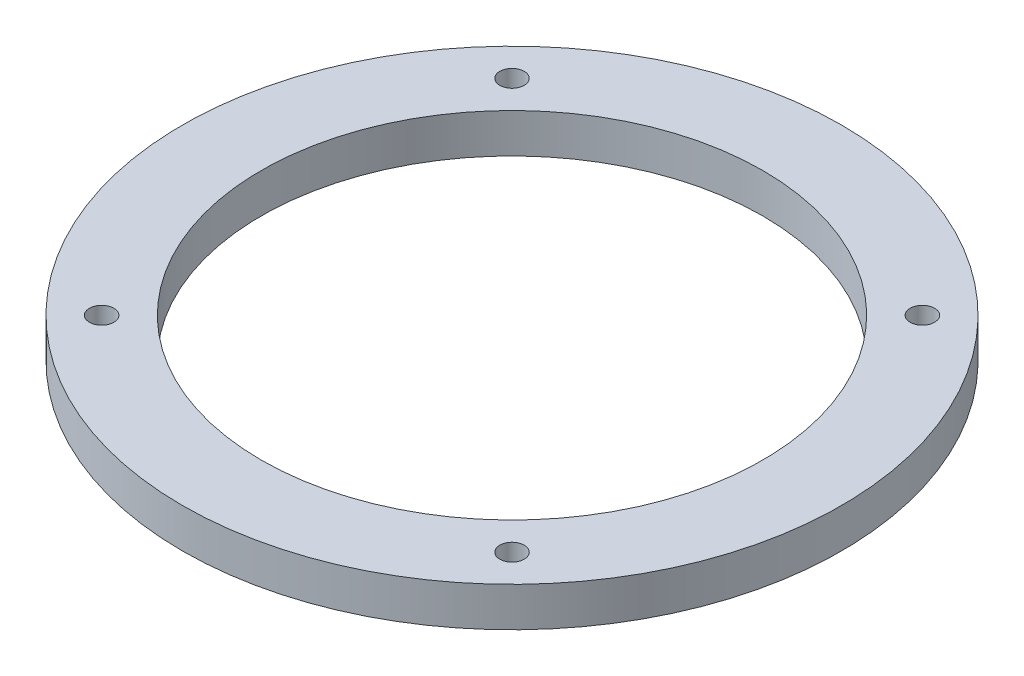
ISO-10303-21;
HEADER;
FILE_DESCRIPTION(('STEP AP214'),'2;1');
FILE_NAME('part.step','',(''),(''),'','','');
FILE_SCHEMA(('AUTOMOTIVE_DESIGN { 1 0 10303 214 1 1 1 1 }'));
ENDSEC;
DATA;
#1=APPLICATION_CONTEXT('core data for automotive mechanical design processes');
#2=APPLICATION_PROTOCOL_DEFINITION('international standard','automotive_design',2000,#1);
#3=PRODUCT_CONTEXT('',#1,'mechanical');
#4=PRODUCT('Part','Part','',(#3));
#5=PRODUCT_RELATED_PRODUCT_CATEGORY('part','',(#4));
#6=PRODUCT_DEFINITION_FORMATION('','',#4);
#7=PRODUCT_DEFINITION_CONTEXT('part definition',#1,'design');
#8=PRODUCT_DEFINITION('design','',#6,#7);
#9=PRODUCT_DEFINITION_SHAPE('','',#8);
#10=(LENGTH_UNIT() NAMED_UNIT(*) SI_UNIT(.MILLI.,.METRE.));
#11=(NAMED_UNIT(*) PLANE_ANGLE_UNIT() SI_UNIT($,.RADIAN.));
#12=(NAMED_UNIT(*) SI_UNIT($,.STERADIAN.) SOLID_ANGLE_UNIT());
#13=UNCERTAINTY_MEASURE_WITH_UNIT(LENGTH_MEASURE(1.E-05),#10,'distance_accuracy_value','');
#14=(GEOMETRIC_REPRESENTATION_CONTEXT(3) GLOBAL_UNCERTAINTY_ASSIGNED_CONTEXT((#13)) GLOBAL_UNIT_ASSIGNED_CONTEXT((#10,
#11,#12)) REPRESENTATION_CONTEXT('',''));
#15=CARTESIAN_POINT('',(0.,0.,0.));
#16=DIRECTION('',(0.,0.,1.));
#17=DIRECTION('',(1.,0.,0.));
#18=AXIS2_PLACEMENT_3D('',#15,#16,#17);
#19=CARTESIAN_POINT('',(0.,5.,0.));
#20=DIRECTION('',(0.,1.,0.));
#21=DIRECTION('',(0.,0.,1.));
#22=AXIS2_PLACEMENT_3D('',#19,#20,#21);
#23=PLANE('',#22);
#24=CARTESIAN_POINT('',(26.0500000000015,5.,26.0499999999985));
#25=DIRECTION('',(0.,1.,0.));
#26=DIRECTION('',(0.,0.,1.));
#27=AXIS2_PLACEMENT_3D('',#24,#25,#26);
#28=CIRCLE('',#27,1.55000000000205);
#29=CARTESIAN_POINT('',(26.0500000000015,5.,27.6000000000006));
#30=VERTEX_POINT('',#29);
#31=EDGE_CURVE('E59',#30,#30,#28,.T.);
#32=ORIENTED_EDGE('',*,*,#31,.F.);
#33=EDGE_LOOP('',(#32));
#34=FACE_BOUND('',#33,.T.);
#35=CARTESIAN_POINT('',(0.,5.,0.));
#36=DIRECTION('',(0.,1.,0.));
#37=DIRECTION('',(0.,0.,1.));
#38=AXIS2_PLACEMENT_3D('',#35,#36,#37);
#39=CIRCLE('',#38,31.8402632998191);
#40=CARTESIAN_POINT('',(0.,5.,31.8402632998191));
#41=VERTEX_POINT('',#40);
#42=EDGE_CURVE('E47',#41,#41,#39,.T.);
#43=ORIENTED_EDGE('',*,*,#42,.F.);
#44=EDGE_LOOP('',(#43));
#45=FACE_BOUND('',#44,.T.);
#46=CARTESIAN_POINT('',(0.,5.,0.));
#47=DIRECTION('',(0.,1.,0.));
#48=DIRECTION('',(0.,0.,1.));
#49=AXIS2_PLACEMENT_3D('',#46,#47,#48);
#50=CIRCLE('',#49,41.8402632998191);
#51=CARTESIAN_POINT('',(0.,5.,41.8402632998191));
#52=VERTEX_POINT('',#51);
#53=EDGE_CURVE('E10',#52,#52,#50,.T.);
#54=ORIENTED_EDGE('',*,*,#53,.T.);
#55=EDGE_LOOP('',(#54));
#56=FACE_BOUND('',#55,.T.);
#57=CARTESIAN_POINT('',(-26.05,5.,-26.05));
#58=DIRECTION('',(0.,1.,0.));
#59=DIRECTION('',(0.,0.,1.));
#60=AXIS2_PLACEMENT_3D('',#57,#58,#59);
#61=CIRCLE('',#60,1.55);
#62=CARTESIAN_POINT('',(-26.05,5.,-24.5));
#63=VERTEX_POINT('',#62);
#64=EDGE_CURVE('E42',#63,#63,#61,.T.);
#65=ORIENTED_EDGE('',*,*,#64,.F.);
#66=EDGE_LOOP('',(#65));
#67=FACE_BOUND('',#66,.T.);
#68=CARTESIAN_POINT('',(26.05,5.,-26.0500000000015));
#69=DIRECTION('',(0.,1.,0.));
#70=DIRECTION('',(0.,0.,1.));
#71=AXIS2_PLACEMENT_3D('',#68,#69,#70);
#72=CIRCLE('',#71,1.55000000000151);
#73=CARTESIAN_POINT('',(26.05,5.,-24.5));
#74=VERTEX_POINT('',#73);
#75=EDGE_CURVE('E53',#74,#74,#72,.T.);
#76=ORIENTED_EDGE('',*,*,#75,.F.);
#77=EDGE_LOOP('',(#76));
#78=FACE_BOUND('',#77,.T.);
#79=CARTESIAN_POINT('',(-26.0499999999985,5.,26.05));
#80=DIRECTION('',(0.,1.,0.));
#81=DIRECTION('',(0.,0.,1.));
#82=AXIS2_PLACEMENT_3D('',#79,#80,#81);
#83=CIRCLE('',#82,1.55000000000077);
#84=CARTESIAN_POINT('',(-26.0499999999985,5.,27.6000000000008));
#85=VERTEX_POINT('',#84);
#86=EDGE_CURVE('E65',#85,#85,#83,.T.);
#87=ORIENTED_EDGE('',*,*,#86,.F.);
#88=EDGE_LOOP('',(#87));
#89=FACE_BOUND('',#88,.T.);
#90=ADVANCED_FACE('F31',(#34,#45,#56,#67,#78,#89),#23,.T.);
#91=CARTESIAN_POINT('',(0.,0.,0.));
#92=DIRECTION('',(0.,1.,0.));
#93=DIRECTION('',(0.,0.,1.));
#94=AXIS2_PLACEMENT_3D('',#91,#92,#93);
#95=PLANE('',#94);
#96=CARTESIAN_POINT('',(0.,0.,0.));
#97=DIRECTION('',(0.,1.,0.));
#98=DIRECTION('',(0.,0.,1.));
#99=AXIS2_PLACEMENT_3D('',#96,#97,#98);
#100=CIRCLE('',#99,41.8402632998191);
#101=CARTESIAN_POINT('',(0.,0.,41.8402632998191));
#102=VERTEX_POINT('',#101);
#103=EDGE_CURVE('E35',#102,#102,#100,.T.);
#104=ORIENTED_EDGE('',*,*,#103,.F.);
#105=EDGE_LOOP('',(#104));
#106=FACE_BOUND('',#105,.T.);
#107=CARTESIAN_POINT('',(-26.05,0.,-26.05));
#108=DIRECTION('',(0.,1.,0.));
#109=DIRECTION('',(0.,0.,1.));
#110=AXIS2_PLACEMENT_3D('',#107,#108,#109);
#111=CIRCLE('',#110,1.55);
#112=CARTESIAN_POINT('',(-26.05,0.,-24.5));
#113=VERTEX_POINT('',#112);
#114=EDGE_CURVE('E44',#113,#113,#111,.T.);
#115=ORIENTED_EDGE('',*,*,#114,.T.);
#116=EDGE_LOOP('',(#115));
#117=FACE_BOUND('',#116,.T.);
#118=CARTESIAN_POINT('',(0.,0.,0.));
#119=DIRECTION('',(0.,1.,0.));
#120=DIRECTION('',(0.,0.,1.));
#121=AXIS2_PLACEMENT_3D('',#118,#119,#120);
#122=CIRCLE('',#121,31.8402632998191);
#123=CARTESIAN_POINT('',(0.,0.,31.8402632998191));
#124=VERTEX_POINT('',#123);
#125=EDGE_CURVE('E50',#124,#124,#122,.T.);
#126=ORIENTED_EDGE('',*,*,#125,.T.);
#127=EDGE_LOOP('',(#126));
#128=FACE_BOUND('',#127,.T.);
#129=CARTESIAN_POINT('',(26.05,0.,-26.0500000000015));
#130=DIRECTION('',(0.,1.,0.));
#131=DIRECTION('',(0.,0.,1.));
#132=AXIS2_PLACEMENT_3D('',#129,#130,#131);
#133=CIRCLE('',#132,1.55000000000151);
#134=CARTESIAN_POINT('',(26.05,0.,-24.5));
#135=VERTEX_POINT('',#134);
#136=EDGE_CURVE('E56',#135,#135,#133,.T.);
#137=ORIENTED_EDGE('',*,*,#136,.T.);
#138=EDGE_LOOP('',(#137));
#139=FACE_BOUND('',#138,.T.);
#140=CARTESIAN_POINT('',(26.0500000000015,0.,26.0499999999985));
#141=DIRECTION('',(0.,1.,0.));
#142=DIRECTION('',(0.,0.,1.));
#143=AXIS2_PLACEMENT_3D('',#140,#141,#142);
#144=CIRCLE('',#143,1.55000000000205);
#145=CARTESIAN_POINT('',(26.0500000000015,0.,27.6000000000006));
#146=VERTEX_POINT('',#145);
#147=EDGE_CURVE('E62',#146,#146,#144,.T.);
#148=ORIENTED_EDGE('',*,*,#147,.T.);
#149=EDGE_LOOP('',(#148));
#150=FACE_BOUND('',#149,.T.);
#151=CARTESIAN_POINT('',(-26.0499999999985,0.,26.05));
#152=DIRECTION('',(0.,1.,0.));
#153=DIRECTION('',(0.,0.,1.));
#154=AXIS2_PLACEMENT_3D('',#151,#152,#153);
#155=CIRCLE('',#154,1.55000000000077);
#156=CARTESIAN_POINT('',(-26.0499999999985,0.,27.6000000000008));
#157=VERTEX_POINT('',#156);
#158=EDGE_CURVE('E68',#157,#157,#155,.T.);
#159=ORIENTED_EDGE('',*,*,#158,.T.);
#160=EDGE_LOOP('',(#159));
#161=FACE_BOUND('',#160,.T.);
#162=ADVANCED_FACE('F78',(#106,#117,#128,#139,#150,#161),#95,.F.);
#163=CARTESIAN_POINT('',(0.,5.,0.));
#164=DIRECTION('',(0.,-1.,0.));
#165=DIRECTION('',(0.,0.,-1.));
#166=AXIS2_PLACEMENT_3D('',#163,#164,#165);
#167=CYLINDRICAL_SURFACE('',#166,41.8402632998191);
#168=ORIENTED_EDGE('',*,*,#53,.F.);
#169=EDGE_LOOP('',(#168));
#170=FACE_BOUND('',#169,.T.);
#171=ORIENTED_EDGE('',*,*,#103,.T.);
#172=EDGE_LOOP('',(#171));
#173=FACE_BOUND('',#172,.T.);
#174=ADVANCED_FACE('F33',(#170,#173),#167,.T.);
#175=CARTESIAN_POINT('',(-26.05,5.,-26.05));
#176=DIRECTION('',(0.,-1.,0.));
#177=DIRECTION('',(0.,0.,-1.));
#178=AXIS2_PLACEMENT_3D('',#175,#176,#177);
#179=CYLINDRICAL_SURFACE('',#178,1.55);
#180=ORIENTED_EDGE('',*,*,#64,.T.);
#181=EDGE_LOOP('',(#180));
#182=FACE_BOUND('',#181,.T.);
#183=ORIENTED_EDGE('',*,*,#114,.F.);
#184=EDGE_LOOP('',(#183));
#185=FACE_BOUND('',#184,.T.);
#186=ADVANCED_FACE('F88',(#182,#185),#179,.F.);
#187=CARTESIAN_POINT('',(0.,5.,0.));
#188=DIRECTION('',(0.,-1.,0.));
#189=DIRECTION('',(0.,0.,-1.));
#190=AXIS2_PLACEMENT_3D('',#187,#188,#189);
#191=CYLINDRICAL_SURFACE('',#190,31.8402632998191);
#192=ORIENTED_EDGE('',*,*,#42,.T.);
#193=EDGE_LOOP('',(#192));
#194=FACE_BOUND('',#193,.T.);
#195=ORIENTED_EDGE('',*,*,#125,.F.);
#196=EDGE_LOOP('',(#195));
#197=FACE_BOUND('',#196,.T.);
#198=ADVANCED_FACE('F91',(#194,#197),#191,.F.);
#199=CARTESIAN_POINT('',(26.05,5.,-26.0500000000015));
#200=DIRECTION('',(0.,-1.,0.));
#201=DIRECTION('',(0.,0.,-1.));
#202=AXIS2_PLACEMENT_3D('',#199,#200,#201);
#203=CYLINDRICAL_SURFACE('',#202,1.55000000000151);
#204=ORIENTED_EDGE('',*,*,#75,.T.);
#205=EDGE_LOOP('',(#204));
#206=FACE_BOUND('',#205,.T.);
#207=ORIENTED_EDGE('',*,*,#136,.F.);
#208=EDGE_LOOP('',(#207));
#209=FACE_BOUND('',#208,.T.);
#210=ADVANCED_FACE('F95',(#206,#209),#203,.F.);
#211=CARTESIAN_POINT('',(26.0500000000015,5.,26.0499999999985));
#212=DIRECTION('',(0.,-1.,0.));
#213=DIRECTION('',(0.,0.,-1.));
#214=AXIS2_PLACEMENT_3D('',#211,#212,#213);
#215=CYLINDRICAL_SURFACE('',#214,1.55000000000205);
#216=ORIENTED_EDGE('',*,*,#31,.T.);
#217=EDGE_LOOP('',(#216));
#218=FACE_BOUND('',#217,.T.);
#219=ORIENTED_EDGE('',*,*,#147,.F.);
#220=EDGE_LOOP('',(#219));
#221=FACE_BOUND('',#220,.T.);
#222=ADVANCED_FACE('F99',(#218,#221),#215,.F.);
#223=CARTESIAN_POINT('',(-26.0499999999985,5.,26.05));
#224=DIRECTION('',(0.,-1.,0.));
#225=DIRECTION('',(0.,0.,-1.));
#226=AXIS2_PLACEMENT_3D('',#223,#224,#225);
#227=CYLINDRICAL_SURFACE('',#226,1.55000000000077);
#228=ORIENTED_EDGE('',*,*,#86,.T.);
#229=EDGE_LOOP('',(#228));
#230=FACE_BOUND('',#229,.T.);
#231=ORIENTED_EDGE('',*,*,#158,.F.);
#232=EDGE_LOOP('',(#231));
#233=FACE_BOUND('',#232,.T.);
#234=ADVANCED_FACE('F74',(#230,#233),#227,.F.);
#235=CLOSED_SHELL('',(#90,#162,#174,#186,#198,#210,#222,#234));
#236=MANIFOLD_SOLID_BREP('B2',#235);
#237=ADVANCED_BREP_SHAPE_REPRESENTATION('',(#18,#236),#14);
#238=SHAPE_DEFINITION_REPRESENTATION(#9,#237);
ENDSEC;
END-ISO-10303-21;
